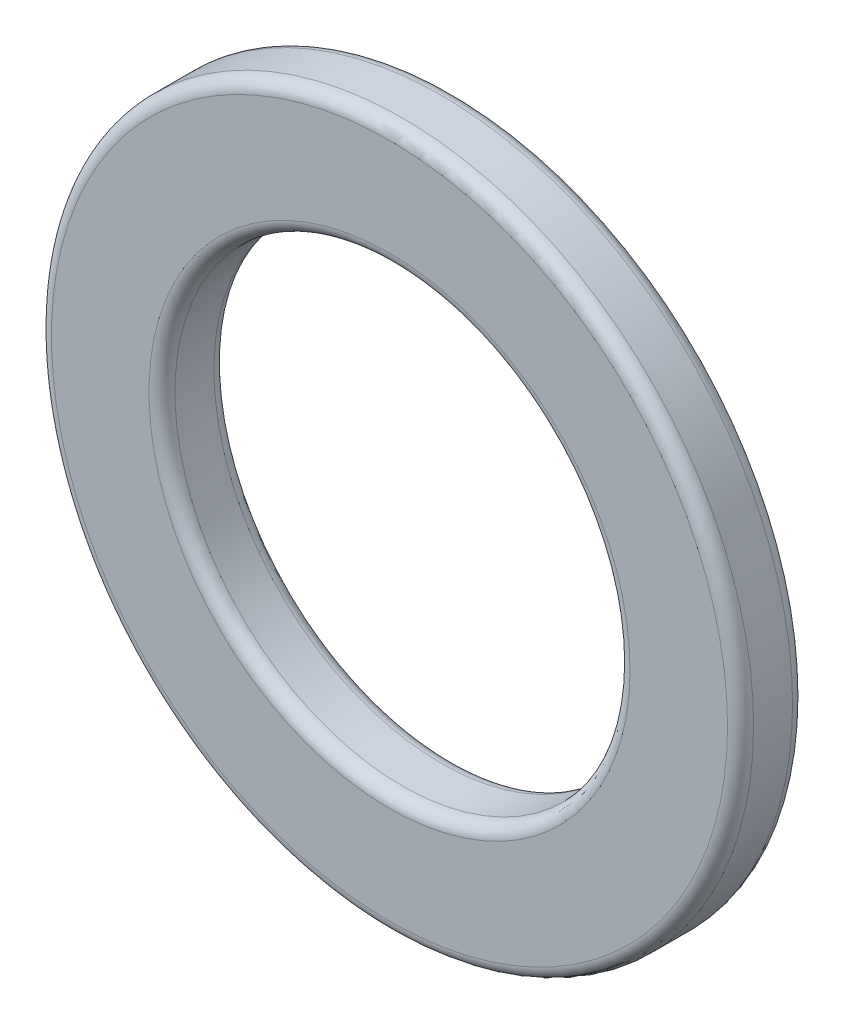
ISO-10303-21;
HEADER;
FILE_DESCRIPTION(('STEP AP214'),'2;1');
FILE_NAME('part.step','',(''),(''),'','','');
FILE_SCHEMA(('AUTOMOTIVE_DESIGN { 1 0 10303 214 1 1 1 1 }'));
ENDSEC;
DATA;
#1=APPLICATION_CONTEXT('core data for automotive mechanical design processes');
#2=APPLICATION_PROTOCOL_DEFINITION('international standard','automotive_design',2000,#1);
#3=PRODUCT_CONTEXT('',#1,'mechanical');
#4=PRODUCT('Part','Part','',(#3));
#5=PRODUCT_RELATED_PRODUCT_CATEGORY('part','',(#4));
#6=PRODUCT_DEFINITION_FORMATION('','',#4);
#7=PRODUCT_DEFINITION_CONTEXT('part definition',#1,'design');
#8=PRODUCT_DEFINITION('design','',#6,#7);
#9=PRODUCT_DEFINITION_SHAPE('','',#8);
#10=(LENGTH_UNIT() NAMED_UNIT(*) SI_UNIT(.MILLI.,.METRE.));
#11=(NAMED_UNIT(*) PLANE_ANGLE_UNIT() SI_UNIT($,.RADIAN.));
#12=(NAMED_UNIT(*) SI_UNIT($,.STERADIAN.) SOLID_ANGLE_UNIT());
#13=UNCERTAINTY_MEASURE_WITH_UNIT(LENGTH_MEASURE(1.E-05),#10,'distance_accuracy_value','');
#14=(GEOMETRIC_REPRESENTATION_CONTEXT(3) GLOBAL_UNCERTAINTY_ASSIGNED_CONTEXT((#13)) GLOBAL_UNIT_ASSIGNED_CONTEXT((#10,
#11,#12)) REPRESENTATION_CONTEXT('',''));
#15=CARTESIAN_POINT('',(0.,0.,0.));
#16=DIRECTION('',(0.,0.,1.));
#17=DIRECTION('',(1.,0.,0.));
#18=AXIS2_PLACEMENT_3D('',#15,#16,#17);
#19=CARTESIAN_POINT('',(0.,0.,1.));
#20=DIRECTION('',(0.,0.,1.));
#21=DIRECTION('',(1.,0.,0.));
#22=AXIS2_PLACEMENT_3D('',#19,#20,#21);
#23=PLANE('',#22);
#24=CARTESIAN_POINT('',(0.,0.,1.));
#25=DIRECTION('',(0.,0.,1.));
#26=DIRECTION('',(1.,0.,0.));
#27=AXIS2_PLACEMENT_3D('',#24,#25,#26);
#28=CIRCLE('',#27,3.7);
#29=CARTESIAN_POINT('',(3.7,0.,1.));
#30=VERTEX_POINT('',#29);
#31=EDGE_CURVE('E48',#30,#30,#28,.F.);
#32=ORIENTED_EDGE('',*,*,#31,.T.);
#33=EDGE_LOOP('',(#32));
#34=FACE_BOUND('',#33,.T.);
#35=CARTESIAN_POINT('',(0.,0.,1.));
#36=DIRECTION('',(0.,0.,1.));
#37=DIRECTION('',(1.,0.,0.));
#38=AXIS2_PLACEMENT_3D('',#35,#36,#37);
#39=CIRCLE('',#38,5.2);
#40=CARTESIAN_POINT('',(5.2,0.,1.));
#41=VERTEX_POINT('',#40);
#42=EDGE_CURVE('E52',#41,#41,#39,.T.);
#43=ORIENTED_EDGE('',*,*,#42,.T.);
#44=EDGE_LOOP('',(#43));
#45=FACE_BOUND('',#44,.T.);
#46=ADVANCED_FACE('F37',(#34,#45),#23,.T.);
#47=CARTESIAN_POINT('',(0.,0.,0.));
#48=DIRECTION('',(0.,0.,1.));
#49=DIRECTION('',(1.,0.,0.));
#50=AXIS2_PLACEMENT_3D('',#47,#48,#49);
#51=PLANE('',#50);
#52=CARTESIAN_POINT('',(0.,0.,0.));
#53=DIRECTION('',(0.,0.,1.));
#54=DIRECTION('',(1.,0.,0.));
#55=AXIS2_PLACEMENT_3D('',#52,#53,#54);
#56=CIRCLE('',#55,3.7);
#57=CARTESIAN_POINT('',(3.7,0.,0.));
#58=VERTEX_POINT('',#57);
#59=EDGE_CURVE('E63',#58,#58,#56,.T.);
#60=ORIENTED_EDGE('',*,*,#59,.T.);
#61=EDGE_LOOP('',(#60));
#62=FACE_BOUND('',#61,.T.);
#63=CARTESIAN_POINT('',(0.,0.,0.));
#64=DIRECTION('',(0.,0.,1.));
#65=DIRECTION('',(1.,0.,0.));
#66=AXIS2_PLACEMENT_3D('',#63,#64,#65);
#67=CIRCLE('',#66,5.2);
#68=CARTESIAN_POINT('',(5.2,0.,0.));
#69=VERTEX_POINT('',#68);
#70=EDGE_CURVE('E66',#69,#69,#67,.F.);
#71=ORIENTED_EDGE('',*,*,#70,.T.);
#72=EDGE_LOOP('',(#71));
#73=FACE_BOUND('',#72,.T.);
#74=ADVANCED_FACE('F70',(#62,#73),#51,.F.);
#75=CARTESIAN_POINT('',(0.,0.,1.));
#76=DIRECTION('',(0.,0.,-1.));
#77=DIRECTION('',(-1.,0.,0.));
#78=AXIS2_PLACEMENT_3D('',#75,#76,#77);
#79=CYLINDRICAL_SURFACE('',#78,5.4);
#80=CARTESIAN_POINT('',(0.,0.,0.2));
#81=DIRECTION('',(0.,0.,1.));
#82=DIRECTION('',(1.,0.,0.));
#83=AXIS2_PLACEMENT_3D('',#80,#81,#82);
#84=CIRCLE('',#83,5.4);
#85=CARTESIAN_POINT('',(5.4,0.,0.2));
#86=VERTEX_POINT('',#85);
#87=EDGE_CURVE('E10',#86,#86,#84,.T.);
#88=ORIENTED_EDGE('',*,*,#87,.T.);
#89=EDGE_LOOP('',(#88));
#90=FACE_BOUND('',#89,.T.);
#91=CARTESIAN_POINT('',(0.,0.,0.8));
#92=DIRECTION('',(0.,0.,1.));
#93=DIRECTION('',(1.,0.,0.));
#94=AXIS2_PLACEMENT_3D('',#91,#92,#93);
#95=CIRCLE('',#94,5.4);
#96=CARTESIAN_POINT('',(5.4,0.,0.8));
#97=VERTEX_POINT('',#96);
#98=EDGE_CURVE('E44',#97,#97,#95,.F.);
#99=ORIENTED_EDGE('',*,*,#98,.T.);
#100=EDGE_LOOP('',(#99));
#101=FACE_BOUND('',#100,.T.);
#102=ADVANCED_FACE('F90',(#90,#101),#79,.T.);
#103=CARTESIAN_POINT('',(0.,0.,1.));
#104=DIRECTION('',(0.,0.,-1.));
#105=DIRECTION('',(-1.,0.,0.));
#106=AXIS2_PLACEMENT_3D('',#103,#104,#105);
#107=CYLINDRICAL_SURFACE('',#106,3.5);
#108=CARTESIAN_POINT('',(0.,0.,0.2));
#109=DIRECTION('',(0.,0.,1.));
#110=DIRECTION('',(1.,0.,0.));
#111=AXIS2_PLACEMENT_3D('',#108,#109,#110);
#112=CIRCLE('',#111,3.5);
#113=CARTESIAN_POINT('',(3.5,0.,0.2));
#114=VERTEX_POINT('',#113);
#115=EDGE_CURVE('E57',#114,#114,#112,.F.);
#116=ORIENTED_EDGE('',*,*,#115,.T.);
#117=EDGE_LOOP('',(#116));
#118=FACE_BOUND('',#117,.T.);
#119=CARTESIAN_POINT('',(0.,0.,0.8));
#120=DIRECTION('',(0.,0.,1.));
#121=DIRECTION('',(1.,0.,0.));
#122=AXIS2_PLACEMENT_3D('',#119,#120,#121);
#123=CIRCLE('',#122,3.5);
#124=CARTESIAN_POINT('',(3.5,0.,0.8));
#125=VERTEX_POINT('',#124);
#126=EDGE_CURVE('E60',#125,#125,#123,.T.);
#127=ORIENTED_EDGE('',*,*,#126,.T.);
#128=EDGE_LOOP('',(#127));
#129=FACE_BOUND('',#128,.T.);
#130=ADVANCED_FACE('F95',(#118,#129),#107,.F.);
#131=CARTESIAN_POINT('',(0.,0.,0.2));
#132=DIRECTION('',(0.,0.,1.));
#133=DIRECTION('',(1.,0.,0.));
#134=AXIS2_PLACEMENT_3D('',#131,#132,#133);
#135=TOROIDAL_SURFACE('',#134,3.7,0.2);
#136=ORIENTED_EDGE('',*,*,#115,.F.);
#137=EDGE_LOOP('',(#136));
#138=FACE_BOUND('',#137,.T.);
#139=ORIENTED_EDGE('',*,*,#59,.F.);
#140=EDGE_LOOP('',(#139));
#141=FACE_BOUND('',#140,.T.);
#142=ADVANCED_FACE('F81',(#138,#141),#135,.T.);
#143=CARTESIAN_POINT('',(0.,0.,0.8));
#144=DIRECTION('',(0.,0.,1.));
#145=DIRECTION('',(1.,0.,0.));
#146=AXIS2_PLACEMENT_3D('',#143,#144,#145);
#147=TOROIDAL_SURFACE('',#146,3.7,0.2);
#148=ORIENTED_EDGE('',*,*,#31,.F.);
#149=EDGE_LOOP('',(#148));
#150=FACE_BOUND('',#149,.T.);
#151=ORIENTED_EDGE('',*,*,#126,.F.);
#152=EDGE_LOOP('',(#151));
#153=FACE_BOUND('',#152,.T.);
#154=ADVANCED_FACE('F75',(#150,#153),#147,.T.);
#155=CARTESIAN_POINT('',(0.,0.,0.2));
#156=DIRECTION('',(0.,0.,1.));
#157=DIRECTION('',(1.,0.,0.));
#158=AXIS2_PLACEMENT_3D('',#155,#156,#157);
#159=TOROIDAL_SURFACE('',#158,5.2,0.2);
#160=ORIENTED_EDGE('',*,*,#70,.F.);
#161=EDGE_LOOP('',(#160));
#162=FACE_BOUND('',#161,.T.);
#163=ORIENTED_EDGE('',*,*,#87,.F.);
#164=EDGE_LOOP('',(#163));
#165=FACE_BOUND('',#164,.T.);
#166=ADVANCED_FACE('F72',(#162,#165),#159,.T.);
#167=CARTESIAN_POINT('',(0.,0.,0.8));
#168=DIRECTION('',(0.,0.,1.));
#169=DIRECTION('',(1.,0.,0.));
#170=AXIS2_PLACEMENT_3D('',#167,#168,#169);
#171=TOROIDAL_SURFACE('',#170,5.2,0.2);
#172=ORIENTED_EDGE('',*,*,#98,.F.);
#173=EDGE_LOOP('',(#172));
#174=FACE_BOUND('',#173,.T.);
#175=ORIENTED_EDGE('',*,*,#42,.F.);
#176=EDGE_LOOP('',(#175));
#177=FACE_BOUND('',#176,.T.);
#178=ADVANCED_FACE('F39',(#174,#177),#171,.T.);
#179=CLOSED_SHELL('',(#46,#74,#102,#130,#142,#154,#166,#178));
#180=MANIFOLD_SOLID_BREP('B2',#179);
#181=ADVANCED_BREP_SHAPE_REPRESENTATION('',(#18,#180),#14);
#182=SHAPE_DEFINITION_REPRESENTATION(#9,#181);
ENDSEC;
END-ISO-10303-21;
